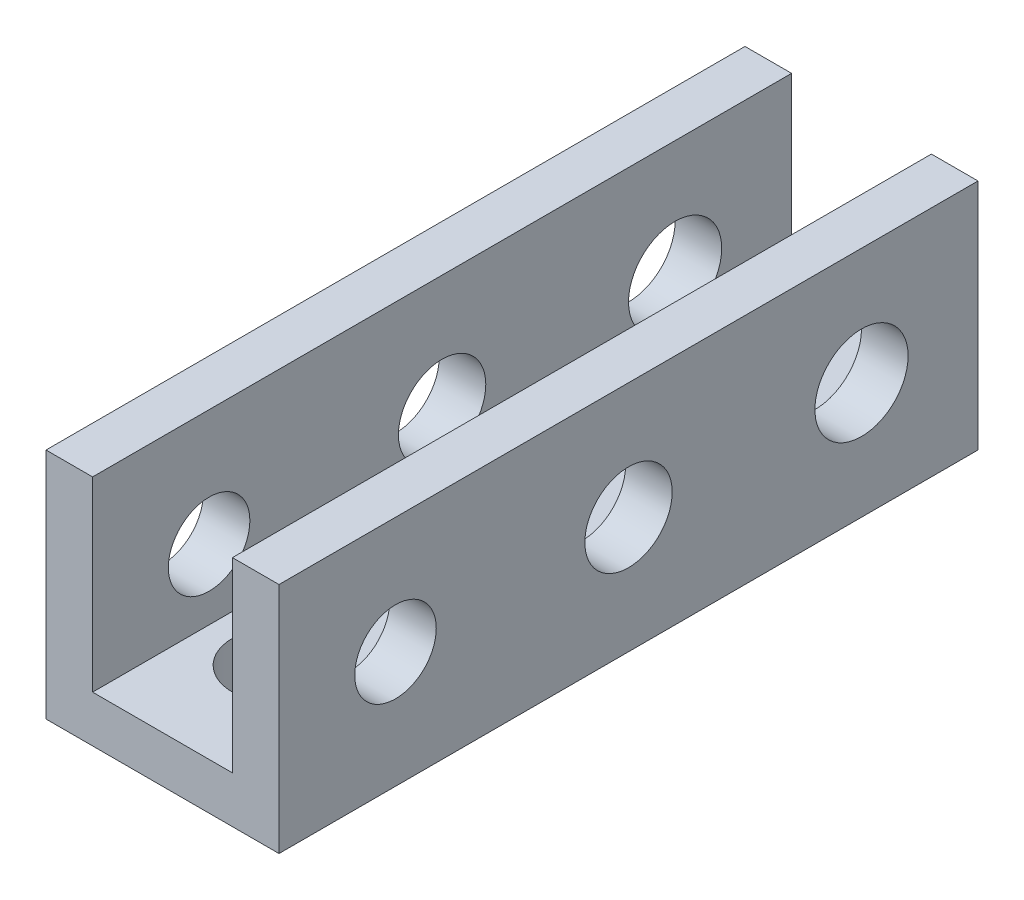
ISO-10303-21;
HEADER;
FILE_DESCRIPTION(('STEP AP214'),'2;1');
FILE_NAME('part.step','',(''),(''),'','','');
FILE_SCHEMA(('AUTOMOTIVE_DESIGN { 1 0 10303 214 1 1 1 1 }'));
ENDSEC;
DATA;
#1=APPLICATION_CONTEXT('core data for automotive mechanical design processes');
#2=APPLICATION_PROTOCOL_DEFINITION('international standard','automotive_design',2000,#1);
#3=PRODUCT_CONTEXT('',#1,'mechanical');
#4=PRODUCT('Part','Part','',(#3));
#5=PRODUCT_RELATED_PRODUCT_CATEGORY('part','',(#4));
#6=PRODUCT_DEFINITION_FORMATION('','',#4);
#7=PRODUCT_DEFINITION_CONTEXT('part definition',#1,'design');
#8=PRODUCT_DEFINITION('design','',#6,#7);
#9=PRODUCT_DEFINITION_SHAPE('','',#8);
#10=(LENGTH_UNIT() NAMED_UNIT(*) SI_UNIT(.MILLI.,.METRE.));
#11=(NAMED_UNIT(*) PLANE_ANGLE_UNIT() SI_UNIT($,.RADIAN.));
#12=(NAMED_UNIT(*) SI_UNIT($,.STERADIAN.) SOLID_ANGLE_UNIT());
#13=UNCERTAINTY_MEASURE_WITH_UNIT(LENGTH_MEASURE(1.E-05),#10,'distance_accuracy_value','');
#14=(GEOMETRIC_REPRESENTATION_CONTEXT(3) GLOBAL_UNCERTAINTY_ASSIGNED_CONTEXT((#13)) GLOBAL_UNIT_ASSIGNED_CONTEXT((#10,
#11,#12)) REPRESENTATION_CONTEXT('',''));
#15=CARTESIAN_POINT('',(0.,0.,0.));
#16=DIRECTION('',(0.,0.,1.));
#17=DIRECTION('',(1.,0.,0.));
#18=AXIS2_PLACEMENT_3D('',#15,#16,#17);
#19=CARTESIAN_POINT('',(-3.,0.999999999999999,30.));
#20=DIRECTION('',(-1.,0.,0.));
#21=DIRECTION('',(0.,0.,1.));
#22=AXIS2_PLACEMENT_3D('',#19,#20,#21);
#23=PLANE('',#22);
#24=CARTESIAN_POINT('',(-3.,4.,25.));
#25=DIRECTION('',(-1.,0.,0.));
#26=DIRECTION('',(0.,0.,1.));
#27=AXIS2_PLACEMENT_3D('',#24,#25,#26);
#28=CIRCLE('',#27,1.75);
#29=CARTESIAN_POINT('',(-3.,4.,26.75));
#30=VERTEX_POINT('',#29);
#31=EDGE_CURVE('E135',#30,#30,#28,.T.);
#32=ORIENTED_EDGE('',*,*,#31,.T.);
#33=EDGE_LOOP('',(#32));
#34=FACE_BOUND('',#33,.T.);
#35=CARTESIAN_POINT('',(-3.,4.,5.));
#36=DIRECTION('',(-1.,0.,0.));
#37=DIRECTION('',(0.,0.,1.));
#38=AXIS2_PLACEMENT_3D('',#35,#36,#37);
#39=CIRCLE('',#38,2.);
#40=CARTESIAN_POINT('',(-3.,4.,7.));
#41=VERTEX_POINT('',#40);
#42=EDGE_CURVE('E164',#41,#41,#39,.T.);
#43=ORIENTED_EDGE('',*,*,#42,.T.);
#44=EDGE_LOOP('',(#43));
#45=FACE_BOUND('',#44,.T.);
#46=CARTESIAN_POINT('',(-3.,4.,15.));
#47=DIRECTION('',(-1.,0.,0.));
#48=DIRECTION('',(0.,0.,1.));
#49=AXIS2_PLACEMENT_3D('',#46,#47,#48);
#50=CIRCLE('',#49,1.875);
#51=CARTESIAN_POINT('',(-3.,4.,16.875));
#52=VERTEX_POINT('',#51);
#53=EDGE_CURVE('E160',#52,#52,#50,.T.);
#54=ORIENTED_EDGE('',*,*,#53,.T.);
#55=EDGE_LOOP('',(#54));
#56=FACE_BOUND('',#55,.T.);
#57=DIRECTION('',(0.,1.,0.));
#58=VECTOR('',#57,1.);
#59=CARTESIAN_POINT('',(-3.,0.999999999999999,0.));
#60=LINE('',#59,#58);
#61=CARTESIAN_POINT('',(-3.,0.999999999999999,0.));
#62=VERTEX_POINT('',#61);
#63=CARTESIAN_POINT('',(-3.,9.,0.));
#64=VERTEX_POINT('',#63);
#65=EDGE_CURVE('E131',#62,#64,#60,.T.);
#66=ORIENTED_EDGE('',*,*,#65,.T.);
#67=DIRECTION('',(0.,0.,-1.));
#68=VECTOR('',#67,1.);
#69=CARTESIAN_POINT('',(-3.,9.,30.));
#70=LINE('',#69,#68);
#71=CARTESIAN_POINT('',(-3.,9.,30.));
#72=VERTEX_POINT('',#71);
#73=EDGE_CURVE('E11',#72,#64,#70,.T.);
#74=ORIENTED_EDGE('',*,*,#73,.F.);
#75=DIRECTION('',(0.,1.,0.));
#76=VECTOR('',#75,1.);
#77=CARTESIAN_POINT('',(-3.,0.999999999999999,30.));
#78=LINE('',#77,#76);
#79=CARTESIAN_POINT('',(-3.,0.999999999999999,30.));
#80=VERTEX_POINT('',#79);
#81=EDGE_CURVE('E146',#80,#72,#78,.T.);
#82=ORIENTED_EDGE('',*,*,#81,.F.);
#83=DIRECTION('',(0.,0.,-1.));
#84=VECTOR('',#83,1.);
#85=CARTESIAN_POINT('',(-3.,0.999999999999999,30.));
#86=LINE('',#85,#84);
#87=EDGE_CURVE('E127',#80,#62,#86,.T.);
#88=ORIENTED_EDGE('',*,*,#87,.T.);
#89=EDGE_LOOP('',(#66,#74,#82,#88));
#90=FACE_BOUND('',#89,.T.);
#91=ADVANCED_FACE('F33',(#34,#45,#56,#90),#23,.F.);
#92=CARTESIAN_POINT('',(-3.,9.,30.));
#93=DIRECTION('',(0.,-1.,0.));
#94=DIRECTION('',(1.,0.,0.));
#95=AXIS2_PLACEMENT_3D('',#92,#93,#94);
#96=PLANE('',#95);
#97=DIRECTION('',(-1.,0.,0.));
#98=VECTOR('',#97,1.);
#99=CARTESIAN_POINT('',(-3.,9.,0.));
#100=LINE('',#99,#98);
#101=CARTESIAN_POINT('',(-5.,9.,0.));
#102=VERTEX_POINT('',#101);
#103=EDGE_CURVE('E134',#64,#102,#100,.T.);
#104=ORIENTED_EDGE('',*,*,#103,.T.);
#105=DIRECTION('',(0.,0.,-1.));
#106=VECTOR('',#105,1.);
#107=CARTESIAN_POINT('',(-5.,9.,30.));
#108=LINE('',#107,#106);
#109=CARTESIAN_POINT('',(-5.,9.,30.));
#110=VERTEX_POINT('',#109);
#111=EDGE_CURVE('E42',#110,#102,#108,.T.);
#112=ORIENTED_EDGE('',*,*,#111,.F.);
#113=DIRECTION('',(-1.,0.,0.));
#114=VECTOR('',#113,1.);
#115=CARTESIAN_POINT('',(-3.,9.,30.));
#116=LINE('',#115,#114);
#117=EDGE_CURVE('E94',#72,#110,#116,.T.);
#118=ORIENTED_EDGE('',*,*,#117,.F.);
#119=ORIENTED_EDGE('',*,*,#73,.T.);
#120=EDGE_LOOP('',(#104,#112,#118,#119));
#121=FACE_BOUND('',#120,.T.);
#122=ADVANCED_FACE('F216',(#121),#96,.F.);
#123=CARTESIAN_POINT('',(-5.,9.,30.));
#124=DIRECTION('',(1.,0.,0.));
#125=DIRECTION('',(0.,1.,0.));
#126=AXIS2_PLACEMENT_3D('',#123,#124,#125);
#127=PLANE('',#126);
#128=CARTESIAN_POINT('',(-5.,4.,25.));
#129=DIRECTION('',(1.,0.,0.));
#130=DIRECTION('',(0.,0.,-1.));
#131=AXIS2_PLACEMENT_3D('',#128,#129,#130);
#132=CIRCLE('',#131,1.75);
#133=CARTESIAN_POINT('',(-5.,4.,23.25));
#134=VERTEX_POINT('',#133);
#135=EDGE_CURVE('E161',#134,#134,#132,.T.);
#136=ORIENTED_EDGE('',*,*,#135,.T.);
#137=EDGE_LOOP('',(#136));
#138=FACE_BOUND('',#137,.T.);
#139=CARTESIAN_POINT('',(-5.,4.,5.));
#140=DIRECTION('',(1.,0.,0.));
#141=DIRECTION('',(0.,0.,-1.));
#142=AXIS2_PLACEMENT_3D('',#139,#140,#141);
#143=CIRCLE('',#142,2.);
#144=CARTESIAN_POINT('',(-5.,4.,3.));
#145=VERTEX_POINT('',#144);
#146=EDGE_CURVE('E258',#145,#145,#143,.T.);
#147=ORIENTED_EDGE('',*,*,#146,.T.);
#148=EDGE_LOOP('',(#147));
#149=FACE_BOUND('',#148,.T.);
#150=CARTESIAN_POINT('',(-5.,4.,15.));
#151=DIRECTION('',(1.,0.,0.));
#152=DIRECTION('',(0.,0.,-1.));
#153=AXIS2_PLACEMENT_3D('',#150,#151,#152);
#154=CIRCLE('',#153,1.875);
#155=CARTESIAN_POINT('',(-5.,4.,13.125));
#156=VERTEX_POINT('',#155);
#157=EDGE_CURVE('E174',#156,#156,#154,.T.);
#158=ORIENTED_EDGE('',*,*,#157,.T.);
#159=EDGE_LOOP('',(#158));
#160=FACE_BOUND('',#159,.T.);
#161=DIRECTION('',(0.,-1.,0.));
#162=VECTOR('',#161,1.);
#163=CARTESIAN_POINT('',(-5.,9.,0.));
#164=LINE('',#163,#162);
#165=CARTESIAN_POINT('',(-5.,-1.,0.));
#166=VERTEX_POINT('',#165);
#167=EDGE_CURVE('E137',#102,#166,#164,.T.);
#168=ORIENTED_EDGE('',*,*,#167,.T.);
#169=DIRECTION('',(0.,0.,-1.));
#170=VECTOR('',#169,1.);
#171=CARTESIAN_POINT('',(-5.,-1.,30.));
#172=LINE('',#171,#170);
#173=CARTESIAN_POINT('',(-5.,-1.,30.));
#174=VERTEX_POINT('',#173);
#175=EDGE_CURVE('E153',#174,#166,#172,.T.);
#176=ORIENTED_EDGE('',*,*,#175,.F.);
#177=DIRECTION('',(0.,-1.,0.));
#178=VECTOR('',#177,1.);
#179=CARTESIAN_POINT('',(-5.,9.,30.));
#180=LINE('',#179,#178);
#181=EDGE_CURVE('E181',#110,#174,#180,.T.);
#182=ORIENTED_EDGE('',*,*,#181,.F.);
#183=ORIENTED_EDGE('',*,*,#111,.T.);
#184=EDGE_LOOP('',(#168,#176,#182,#183));
#185=FACE_BOUND('',#184,.T.);
#186=ADVANCED_FACE('F221',(#138,#149,#160,#185),#127,.F.);
#187=CARTESIAN_POINT('',(-5.,-1.,30.));
#188=DIRECTION('',(0.,1.,0.));
#189=DIRECTION('',(-1.,0.,0.));
#190=AXIS2_PLACEMENT_3D('',#187,#188,#189);
#191=PLANE('',#190);
#192=CARTESIAN_POINT('',(0.,-0.999999999999999,5.));
#193=DIRECTION('',(0.,1.,0.));
#194=DIRECTION('',(-1.,0.,0.));
#195=AXIS2_PLACEMENT_3D('',#192,#193,#194);
#196=CIRCLE('',#195,1.75);
#197=CARTESIAN_POINT('',(-1.75,-0.999999999999999,5.));
#198=VERTEX_POINT('',#197);
#199=EDGE_CURVE('E268',#198,#198,#196,.T.);
#200=ORIENTED_EDGE('',*,*,#199,.T.);
#201=EDGE_LOOP('',(#200));
#202=FACE_BOUND('',#201,.T.);
#203=CARTESIAN_POINT('',(0.,-0.999999999999999,15.));
#204=DIRECTION('',(0.,1.,0.));
#205=DIRECTION('',(-1.,0.,0.));
#206=AXIS2_PLACEMENT_3D('',#203,#204,#205);
#207=CIRCLE('',#206,1.875);
#208=CARTESIAN_POINT('',(-1.875,-0.999999999999999,15.));
#209=VERTEX_POINT('',#208);
#210=EDGE_CURVE('E271',#209,#209,#207,.T.);
#211=ORIENTED_EDGE('',*,*,#210,.T.);
#212=EDGE_LOOP('',(#211));
#213=FACE_BOUND('',#212,.T.);
#214=CARTESIAN_POINT('',(0.,-0.999999999999999,25.));
#215=DIRECTION('',(0.,1.,0.));
#216=DIRECTION('',(-1.,0.,0.));
#217=AXIS2_PLACEMENT_3D('',#214,#215,#216);
#218=CIRCLE('',#217,2.);
#219=CARTESIAN_POINT('',(-2.,-0.999999999999999,25.));
#220=VERTEX_POINT('',#219);
#221=EDGE_CURVE('E276',#220,#220,#218,.T.);
#222=ORIENTED_EDGE('',*,*,#221,.T.);
#223=EDGE_LOOP('',(#222));
#224=FACE_BOUND('',#223,.T.);
#225=DIRECTION('',(1.,0.,0.));
#226=VECTOR('',#225,1.);
#227=CARTESIAN_POINT('',(-5.,-1.,0.));
#228=LINE('',#227,#226);
#229=CARTESIAN_POINT('',(5.,-0.999999999999999,0.));
#230=VERTEX_POINT('',#229);
#231=EDGE_CURVE('E139',#166,#230,#228,.T.);
#232=ORIENTED_EDGE('',*,*,#231,.T.);
#233=DIRECTION('',(0.,0.,-1.));
#234=VECTOR('',#233,1.);
#235=CARTESIAN_POINT('',(5.,-0.999999999999999,30.));
#236=LINE('',#235,#234);
#237=CARTESIAN_POINT('',(5.,-0.999999999999999,30.));
#238=VERTEX_POINT('',#237);
#239=EDGE_CURVE('E150',#238,#230,#236,.T.);
#240=ORIENTED_EDGE('',*,*,#239,.F.);
#241=DIRECTION('',(1.,0.,0.));
#242=VECTOR('',#241,1.);
#243=CARTESIAN_POINT('',(-5.,-1.,30.));
#244=LINE('',#243,#242);
#245=EDGE_CURVE('E183',#174,#238,#244,.T.);
#246=ORIENTED_EDGE('',*,*,#245,.F.);
#247=ORIENTED_EDGE('',*,*,#175,.T.);
#248=EDGE_LOOP('',(#232,#240,#246,#247));
#249=FACE_BOUND('',#248,.T.);
#250=ADVANCED_FACE('F189',(#202,#213,#224,#249),#191,.F.);
#251=CARTESIAN_POINT('',(5.,9.,30.));
#252=DIRECTION('',(-1.,0.,0.));
#253=DIRECTION('',(0.,-1.,0.));
#254=AXIS2_PLACEMENT_3D('',#251,#252,#253);
#255=PLANE('',#254);
#256=CARTESIAN_POINT('',(5.,4.,25.));
#257=DIRECTION('',(1.,0.,0.));
#258=DIRECTION('',(0.,0.,-1.));
#259=AXIS2_PLACEMENT_3D('',#256,#257,#258);
#260=CIRCLE('',#259,1.75);
#261=CARTESIAN_POINT('',(5.,4.,23.25));
#262=VERTEX_POINT('',#261);
#263=EDGE_CURVE('E261',#262,#262,#260,.T.);
#264=ORIENTED_EDGE('',*,*,#263,.F.);
#265=EDGE_LOOP('',(#264));
#266=FACE_BOUND('',#265,.T.);
#267=CARTESIAN_POINT('',(5.,4.,5.));
#268=DIRECTION('',(1.,0.,0.));
#269=DIRECTION('',(0.,0.,-1.));
#270=AXIS2_PLACEMENT_3D('',#267,#268,#269);
#271=CIRCLE('',#270,2.);
#272=CARTESIAN_POINT('',(5.,4.,3.));
#273=VERTEX_POINT('',#272);
#274=EDGE_CURVE('E256',#273,#273,#271,.T.);
#275=ORIENTED_EDGE('',*,*,#274,.F.);
#276=EDGE_LOOP('',(#275));
#277=FACE_BOUND('',#276,.T.);
#278=CARTESIAN_POINT('',(5.,4.,15.));
#279=DIRECTION('',(1.,0.,0.));
#280=DIRECTION('',(0.,0.,-1.));
#281=AXIS2_PLACEMENT_3D('',#278,#279,#280);
#282=CIRCLE('',#281,1.875);
#283=CARTESIAN_POINT('',(5.,4.,13.125));
#284=VERTEX_POINT('',#283);
#285=EDGE_CURVE('E264',#284,#284,#282,.T.);
#286=ORIENTED_EDGE('',*,*,#285,.F.);
#287=EDGE_LOOP('',(#286));
#288=FACE_BOUND('',#287,.T.);
#289=DIRECTION('',(0.,1.,0.));
#290=VECTOR('',#289,1.);
#291=CARTESIAN_POINT('',(5.,9.,0.));
#292=LINE('',#291,#290);
#293=CARTESIAN_POINT('',(5.,9.,0.));
#294=VERTEX_POINT('',#293);
#295=EDGE_CURVE('E141',#230,#294,#292,.T.);
#296=ORIENTED_EDGE('',*,*,#295,.T.);
#297=DIRECTION('',(0.,0.,-1.));
#298=VECTOR('',#297,1.);
#299=CARTESIAN_POINT('',(5.,9.,30.));
#300=LINE('',#299,#298);
#301=CARTESIAN_POINT('',(5.,9.,30.));
#302=VERTEX_POINT('',#301);
#303=EDGE_CURVE('E122',#302,#294,#300,.T.);
#304=ORIENTED_EDGE('',*,*,#303,.F.);
#305=DIRECTION('',(0.,1.,0.));
#306=VECTOR('',#305,1.);
#307=CARTESIAN_POINT('',(5.,9.,30.));
#308=LINE('',#307,#306);
#309=EDGE_CURVE('E113',#238,#302,#308,.T.);
#310=ORIENTED_EDGE('',*,*,#309,.F.);
#311=ORIENTED_EDGE('',*,*,#239,.T.);
#312=EDGE_LOOP('',(#296,#304,#310,#311));
#313=FACE_BOUND('',#312,.T.);
#314=ADVANCED_FACE('F193',(#266,#277,#288,#313),#255,.F.);
#315=CARTESIAN_POINT('',(3.,9.,30.));
#316=DIRECTION('',(0.,-1.,0.));
#317=DIRECTION('',(1.,0.,0.));
#318=AXIS2_PLACEMENT_3D('',#315,#316,#317);
#319=PLANE('',#318);
#320=DIRECTION('',(-1.,0.,0.));
#321=VECTOR('',#320,1.);
#322=CARTESIAN_POINT('',(3.,9.,0.));
#323=LINE('',#322,#321);
#324=CARTESIAN_POINT('',(3.,9.,0.));
#325=VERTEX_POINT('',#324);
#326=EDGE_CURVE('E121',#294,#325,#323,.T.);
#327=ORIENTED_EDGE('',*,*,#326,.T.);
#328=DIRECTION('',(0.,0.,-1.));
#329=VECTOR('',#328,1.);
#330=CARTESIAN_POINT('',(3.,9.,30.));
#331=LINE('',#330,#329);
#332=CARTESIAN_POINT('',(3.,9.,30.));
#333=VERTEX_POINT('',#332);
#334=EDGE_CURVE('E118',#333,#325,#331,.T.);
#335=ORIENTED_EDGE('',*,*,#334,.F.);
#336=DIRECTION('',(-1.,0.,0.));
#337=VECTOR('',#336,1.);
#338=CARTESIAN_POINT('',(3.,9.,30.));
#339=LINE('',#338,#337);
#340=EDGE_CURVE('E107',#302,#333,#339,.T.);
#341=ORIENTED_EDGE('',*,*,#340,.F.);
#342=ORIENTED_EDGE('',*,*,#303,.T.);
#343=EDGE_LOOP('',(#327,#335,#341,#342));
#344=FACE_BOUND('',#343,.T.);
#345=ADVANCED_FACE('F119',(#344),#319,.F.);
#346=CARTESIAN_POINT('',(3.,1.,30.));
#347=DIRECTION('',(1.,0.,0.));
#348=DIRECTION('',(0.,1.,0.));
#349=AXIS2_PLACEMENT_3D('',#346,#347,#348);
#350=PLANE('',#349);
#351=CARTESIAN_POINT('',(3.,4.,25.));
#352=DIRECTION('',(1.,0.,0.));
#353=DIRECTION('',(0.,1.,0.));
#354=AXIS2_PLACEMENT_3D('',#351,#352,#353);
#355=CIRCLE('',#354,1.75);
#356=CARTESIAN_POINT('',(3.,5.75,25.));
#357=VERTEX_POINT('',#356);
#358=EDGE_CURVE('E36',#357,#357,#355,.T.);
#359=ORIENTED_EDGE('',*,*,#358,.T.);
#360=EDGE_LOOP('',(#359));
#361=FACE_BOUND('',#360,.T.);
#362=CARTESIAN_POINT('',(3.,4.,5.));
#363=DIRECTION('',(1.,0.,0.));
#364=DIRECTION('',(0.,1.,0.));
#365=AXIS2_PLACEMENT_3D('',#362,#363,#364);
#366=CIRCLE('',#365,2.);
#367=CARTESIAN_POINT('',(3.,6.,5.));
#368=VERTEX_POINT('',#367);
#369=EDGE_CURVE('E162',#368,#368,#366,.T.);
#370=ORIENTED_EDGE('',*,*,#369,.T.);
#371=EDGE_LOOP('',(#370));
#372=FACE_BOUND('',#371,.T.);
#373=CARTESIAN_POINT('',(3.,4.,15.));
#374=DIRECTION('',(1.,0.,0.));
#375=DIRECTION('',(0.,1.,0.));
#376=AXIS2_PLACEMENT_3D('',#373,#374,#375);
#377=CIRCLE('',#376,1.875);
#378=CARTESIAN_POINT('',(3.,5.875,15.));
#379=VERTEX_POINT('',#378);
#380=EDGE_CURVE('E158',#379,#379,#377,.T.);
#381=ORIENTED_EDGE('',*,*,#380,.T.);
#382=EDGE_LOOP('',(#381));
#383=FACE_BOUND('',#382,.T.);
#384=DIRECTION('',(0.,-1.,0.));
#385=VECTOR('',#384,1.);
#386=CARTESIAN_POINT('',(3.,1.,0.));
#387=LINE('',#386,#385);
#388=CARTESIAN_POINT('',(3.,1.,0.));
#389=VERTEX_POINT('',#388);
#390=EDGE_CURVE('E80',#325,#389,#387,.T.);
#391=ORIENTED_EDGE('',*,*,#390,.T.);
#392=DIRECTION('',(0.,0.,-1.));
#393=VECTOR('',#392,1.);
#394=CARTESIAN_POINT('',(3.,1.,30.));
#395=LINE('',#394,#393);
#396=CARTESIAN_POINT('',(3.,1.,30.));
#397=VERTEX_POINT('',#396);
#398=EDGE_CURVE('E123',#397,#389,#395,.T.);
#399=ORIENTED_EDGE('',*,*,#398,.F.);
#400=DIRECTION('',(0.,-1.,0.));
#401=VECTOR('',#400,1.);
#402=CARTESIAN_POINT('',(3.,1.,30.));
#403=LINE('',#402,#401);
#404=EDGE_CURVE('E111',#333,#397,#403,.T.);
#405=ORIENTED_EDGE('',*,*,#404,.F.);
#406=ORIENTED_EDGE('',*,*,#334,.T.);
#407=EDGE_LOOP('',(#391,#399,#405,#406));
#408=FACE_BOUND('',#407,.T.);
#409=ADVANCED_FACE('F125',(#361,#372,#383,#408),#350,.F.);
#410=CARTESIAN_POINT('',(3.,1.,30.));
#411=DIRECTION('',(0.,-1.,0.));
#412=DIRECTION('',(1.,0.,0.));
#413=AXIS2_PLACEMENT_3D('',#410,#411,#412);
#414=PLANE('',#413);
#415=CARTESIAN_POINT('',(0.,1.,5.));
#416=DIRECTION('',(0.,1.,0.));
#417=DIRECTION('',(-1.,0.,0.));
#418=AXIS2_PLACEMENT_3D('',#415,#416,#417);
#419=CIRCLE('',#418,1.75);
#420=CARTESIAN_POINT('',(-1.75,0.999999999999999,5.));
#421=VERTEX_POINT('',#420);
#422=EDGE_CURVE('E394',#421,#421,#419,.T.);
#423=ORIENTED_EDGE('',*,*,#422,.F.);
#424=EDGE_LOOP('',(#423));
#425=FACE_BOUND('',#424,.T.);
#426=CARTESIAN_POINT('',(0.,1.,15.));
#427=DIRECTION('',(0.,1.,0.));
#428=DIRECTION('',(-1.,0.,0.));
#429=AXIS2_PLACEMENT_3D('',#426,#427,#428);
#430=CIRCLE('',#429,1.875);
#431=CARTESIAN_POINT('',(-1.875,0.999999999999999,15.));
#432=VERTEX_POINT('',#431);
#433=EDGE_CURVE('E395',#432,#432,#430,.T.);
#434=ORIENTED_EDGE('',*,*,#433,.F.);
#435=EDGE_LOOP('',(#434));
#436=FACE_BOUND('',#435,.T.);
#437=CARTESIAN_POINT('',(0.,1.,25.));
#438=DIRECTION('',(0.,1.,0.));
#439=DIRECTION('',(-1.,0.,0.));
#440=AXIS2_PLACEMENT_3D('',#437,#438,#439);
#441=CIRCLE('',#440,2.);
#442=CARTESIAN_POINT('',(-2.,0.999999999999999,25.));
#443=VERTEX_POINT('',#442);
#444=EDGE_CURVE('E399',#443,#443,#441,.T.);
#445=ORIENTED_EDGE('',*,*,#444,.F.);
#446=EDGE_LOOP('',(#445));
#447=FACE_BOUND('',#446,.T.);
#448=DIRECTION('',(-1.,0.,0.));
#449=VECTOR('',#448,1.);
#450=CARTESIAN_POINT('',(3.,1.,0.));
#451=LINE('',#450,#449);
#452=EDGE_CURVE('E86',#389,#62,#451,.T.);
#453=ORIENTED_EDGE('',*,*,#452,.T.);
#454=ORIENTED_EDGE('',*,*,#87,.F.);
#455=DIRECTION('',(-1.,0.,0.));
#456=VECTOR('',#455,1.);
#457=CARTESIAN_POINT('',(3.,1.,30.));
#458=LINE('',#457,#456);
#459=EDGE_CURVE('E51',#397,#80,#458,.T.);
#460=ORIENTED_EDGE('',*,*,#459,.F.);
#461=ORIENTED_EDGE('',*,*,#398,.T.);
#462=EDGE_LOOP('',(#453,#454,#460,#461));
#463=FACE_BOUND('',#462,.T.);
#464=ADVANCED_FACE('F201',(#425,#436,#447,#463),#414,.F.);
#465=CARTESIAN_POINT('',(0.,0.,30.));
#466=DIRECTION('',(0.,0.,1.));
#467=DIRECTION('',(1.,0.,0.));
#468=AXIS2_PLACEMENT_3D('',#465,#466,#467);
#469=PLANE('',#468);
#470=ORIENTED_EDGE('',*,*,#81,.T.);
#471=ORIENTED_EDGE('',*,*,#117,.T.);
#472=ORIENTED_EDGE('',*,*,#181,.T.);
#473=ORIENTED_EDGE('',*,*,#245,.T.);
#474=ORIENTED_EDGE('',*,*,#309,.T.);
#475=ORIENTED_EDGE('',*,*,#340,.T.);
#476=ORIENTED_EDGE('',*,*,#404,.T.);
#477=ORIENTED_EDGE('',*,*,#459,.T.);
#478=EDGE_LOOP('',(#470,#471,#472,#473,#474,#475,#476,#477));
#479=FACE_BOUND('',#478,.T.);
#480=ADVANCED_FACE('F109',(#479),#469,.T.);
#481=CARTESIAN_POINT('',(0.,0.,0.));
#482=DIRECTION('',(0.,0.,1.));
#483=DIRECTION('',(1.,0.,0.));
#484=AXIS2_PLACEMENT_3D('',#481,#482,#483);
#485=PLANE('',#484);
#486=ORIENTED_EDGE('',*,*,#65,.F.);
#487=ORIENTED_EDGE('',*,*,#452,.F.);
#488=ORIENTED_EDGE('',*,*,#390,.F.);
#489=ORIENTED_EDGE('',*,*,#326,.F.);
#490=ORIENTED_EDGE('',*,*,#295,.F.);
#491=ORIENTED_EDGE('',*,*,#231,.F.);
#492=ORIENTED_EDGE('',*,*,#167,.F.);
#493=ORIENTED_EDGE('',*,*,#103,.F.);
#494=EDGE_LOOP('',(#486,#487,#488,#489,#490,#491,#492,#493));
#495=FACE_BOUND('',#494,.T.);
#496=ADVANCED_FACE('F196',(#495),#485,.F.);
#497=CARTESIAN_POINT('',(-5.,4.,15.));
#498=DIRECTION('',(1.,0.,0.));
#499=DIRECTION('',(0.,0.,-1.));
#500=AXIS2_PLACEMENT_3D('',#497,#498,#499);
#501=CYLINDRICAL_SURFACE('',#500,1.875);
#502=ORIENTED_EDGE('',*,*,#285,.T.);
#503=EDGE_LOOP('',(#502));
#504=FACE_BOUND('',#503,.T.);
#505=ORIENTED_EDGE('',*,*,#380,.F.);
#506=EDGE_LOOP('',(#505));
#507=FACE_BOUND('',#506,.T.);
#508=ADVANCED_FACE('F243',(#504,#507),#501,.F.);
#509=CARTESIAN_POINT('',(-5.,4.,5.));
#510=DIRECTION('',(1.,0.,0.));
#511=DIRECTION('',(0.,0.,-1.));
#512=AXIS2_PLACEMENT_3D('',#509,#510,#511);
#513=CYLINDRICAL_SURFACE('',#512,2.);
#514=ORIENTED_EDGE('',*,*,#274,.T.);
#515=EDGE_LOOP('',(#514));
#516=FACE_BOUND('',#515,.T.);
#517=ORIENTED_EDGE('',*,*,#369,.F.);
#518=EDGE_LOOP('',(#517));
#519=FACE_BOUND('',#518,.T.);
#520=ADVANCED_FACE('F232',(#516,#519),#513,.F.);
#521=CARTESIAN_POINT('',(-5.,4.,25.));
#522=DIRECTION('',(1.,0.,0.));
#523=DIRECTION('',(0.,0.,-1.));
#524=AXIS2_PLACEMENT_3D('',#521,#522,#523);
#525=CYLINDRICAL_SURFACE('',#524,1.75);
#526=ORIENTED_EDGE('',*,*,#263,.T.);
#527=EDGE_LOOP('',(#526));
#528=FACE_BOUND('',#527,.T.);
#529=ORIENTED_EDGE('',*,*,#358,.F.);
#530=EDGE_LOOP('',(#529));
#531=FACE_BOUND('',#530,.T.);
#532=ADVANCED_FACE('F240',(#528,#531),#525,.F.);
#533=ORIENTED_EDGE('',*,*,#157,.F.);
#534=EDGE_LOOP('',(#533));
#535=FACE_BOUND('',#534,.T.);
#536=ORIENTED_EDGE('',*,*,#53,.F.);
#537=EDGE_LOOP('',(#536));
#538=FACE_BOUND('',#537,.T.);
#539=ADVANCED_FACE('F229',(#535,#538),#501,.F.);
#540=ORIENTED_EDGE('',*,*,#146,.F.);
#541=EDGE_LOOP('',(#540));
#542=FACE_BOUND('',#541,.T.);
#543=ORIENTED_EDGE('',*,*,#42,.F.);
#544=EDGE_LOOP('',(#543));
#545=FACE_BOUND('',#544,.T.);
#546=ADVANCED_FACE('F226',(#542,#545),#513,.F.);
#547=ORIENTED_EDGE('',*,*,#135,.F.);
#548=EDGE_LOOP('',(#547));
#549=FACE_BOUND('',#548,.T.);
#550=ORIENTED_EDGE('',*,*,#31,.F.);
#551=EDGE_LOOP('',(#550));
#552=FACE_BOUND('',#551,.T.);
#553=ADVANCED_FACE('F228',(#549,#552),#525,.F.);
#554=CARTESIAN_POINT('',(0.,-9.,25.));
#555=DIRECTION('',(0.,1.,0.));
#556=DIRECTION('',(-1.,0.,0.));
#557=AXIS2_PLACEMENT_3D('',#554,#555,#556);
#558=CYLINDRICAL_SURFACE('',#557,2.);
#559=ORIENTED_EDGE('',*,*,#444,.T.);
#560=EDGE_LOOP('',(#559));
#561=FACE_BOUND('',#560,.T.);
#562=ORIENTED_EDGE('',*,*,#221,.F.);
#563=EDGE_LOOP('',(#562));
#564=FACE_BOUND('',#563,.T.);
#565=ADVANCED_FACE('F237',(#561,#564),#558,.F.);
#566=CARTESIAN_POINT('',(0.,-9.,15.));
#567=DIRECTION('',(0.,1.,0.));
#568=DIRECTION('',(-1.,0.,0.));
#569=AXIS2_PLACEMENT_3D('',#566,#567,#568);
#570=CYLINDRICAL_SURFACE('',#569,1.875);
#571=ORIENTED_EDGE('',*,*,#433,.T.);
#572=EDGE_LOOP('',(#571));
#573=FACE_BOUND('',#572,.T.);
#574=ORIENTED_EDGE('',*,*,#210,.F.);
#575=EDGE_LOOP('',(#574));
#576=FACE_BOUND('',#575,.T.);
#577=ADVANCED_FACE('F368',(#573,#576),#570,.F.);
#578=CARTESIAN_POINT('',(0.,-9.,5.));
#579=DIRECTION('',(0.,1.,0.));
#580=DIRECTION('',(-1.,0.,0.));
#581=AXIS2_PLACEMENT_3D('',#578,#579,#580);
#582=CYLINDRICAL_SURFACE('',#581,1.75);
#583=ORIENTED_EDGE('',*,*,#422,.T.);
#584=EDGE_LOOP('',(#583));
#585=FACE_BOUND('',#584,.T.);
#586=ORIENTED_EDGE('',*,*,#199,.F.);
#587=EDGE_LOOP('',(#586));
#588=FACE_BOUND('',#587,.T.);
#589=ADVANCED_FACE('F378',(#585,#588),#582,.F.);
#590=CLOSED_SHELL('',(#91,#122,#186,#250,#314,#345,#409,#464,#480,#496,#508,#520,#532,#539,#546,
#553,#565,#577,#589));
#591=MANIFOLD_SOLID_BREP('B2',#590);
#592=ADVANCED_BREP_SHAPE_REPRESENTATION('',(#18,#591),#14);
#593=SHAPE_DEFINITION_REPRESENTATION(#9,#592);
ENDSEC;
END-ISO-10303-21;
